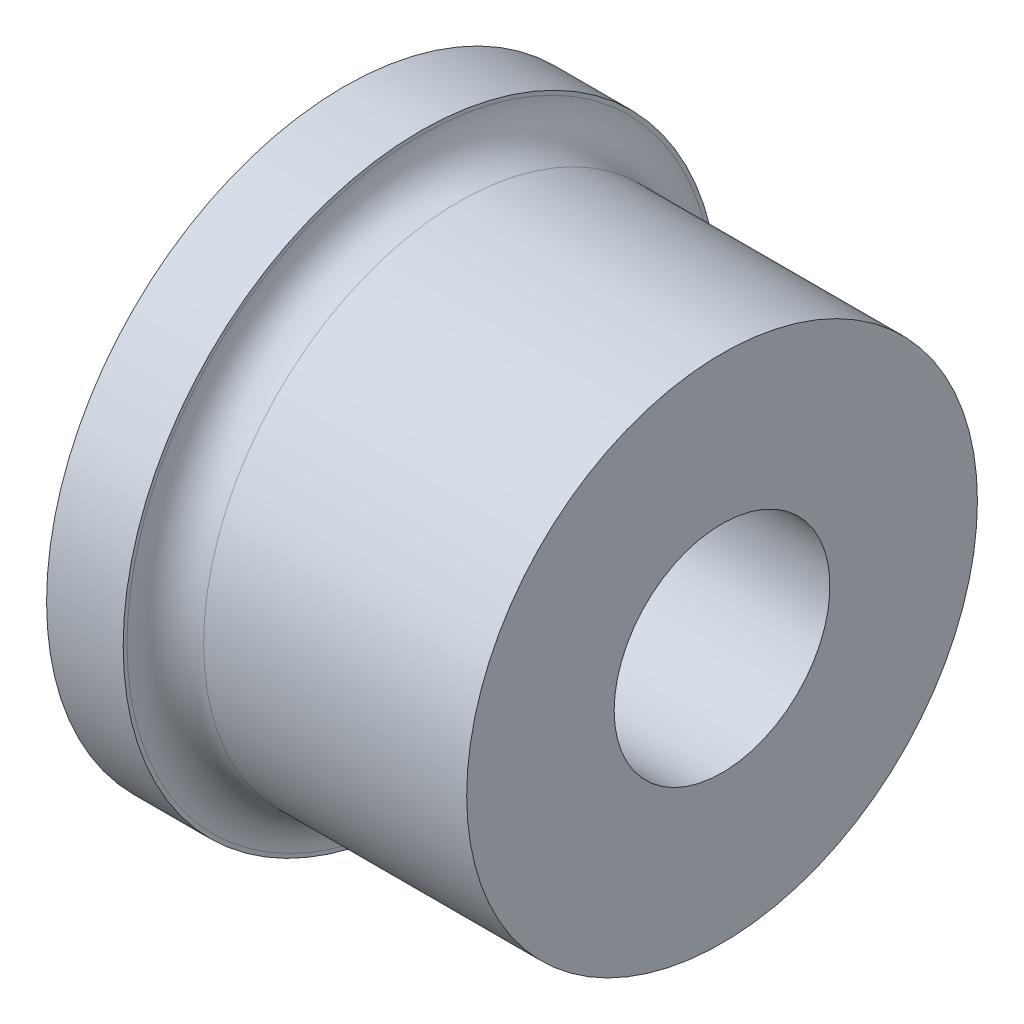
ISO-10303-21;
HEADER;
FILE_DESCRIPTION(('STEP AP214'),'2;1');
FILE_NAME('part.step','',(''),(''),'','','');
FILE_SCHEMA(('AUTOMOTIVE_DESIGN { 1 0 10303 214 1 1 1 1 }'));
ENDSEC;
DATA;
#1=APPLICATION_CONTEXT('core data for automotive mechanical design processes');
#2=APPLICATION_PROTOCOL_DEFINITION('international standard','automotive_design',2000,#1);
#3=PRODUCT_CONTEXT('',#1,'mechanical');
#4=PRODUCT('Part','Part','',(#3));
#5=PRODUCT_RELATED_PRODUCT_CATEGORY('part','',(#4));
#6=PRODUCT_DEFINITION_FORMATION('','',#4);
#7=PRODUCT_DEFINITION_CONTEXT('part definition',#1,'design');
#8=PRODUCT_DEFINITION('design','',#6,#7);
#9=PRODUCT_DEFINITION_SHAPE('','',#8);
#10=(LENGTH_UNIT() NAMED_UNIT(*) SI_UNIT(.MILLI.,.METRE.));
#11=(NAMED_UNIT(*) PLANE_ANGLE_UNIT() SI_UNIT($,.RADIAN.));
#12=(NAMED_UNIT(*) SI_UNIT($,.STERADIAN.) SOLID_ANGLE_UNIT());
#13=UNCERTAINTY_MEASURE_WITH_UNIT(LENGTH_MEASURE(1.E-05),#10,'distance_accuracy_value','');
#14=(GEOMETRIC_REPRESENTATION_CONTEXT(3) GLOBAL_UNCERTAINTY_ASSIGNED_CONTEXT((#13)) GLOBAL_UNIT_ASSIGNED_CONTEXT((#10,
#11,#12)) REPRESENTATION_CONTEXT('',''));
#15=CARTESIAN_POINT('',(0.,0.,0.));
#16=DIRECTION('',(0.,0.,1.));
#17=DIRECTION('',(1.,0.,0.));
#18=AXIS2_PLACEMENT_3D('',#15,#16,#17);
#19=CARTESIAN_POINT('',(-20.8,0.,0.));
#20=DIRECTION('',(1.,0.,0.));
#21=DIRECTION('',(0.,0.,-1.));
#22=AXIS2_PLACEMENT_3D('',#19,#20,#21);
#23=CONICAL_SURFACE('',#22,1.65,0.507629008321349);
#24=CARTESIAN_POINT('',(-21.8,0.,0.));
#25=DIRECTION('',(-1.,0.,0.));
#26=DIRECTION('',(0.,0.,1.));
#27=AXIS2_PLACEMENT_3D('',#24,#25,#26);
#28=CIRCLE('',#27,1.09375);
#29=CARTESIAN_POINT('',(-21.8,0.,1.09375));
#30=VERTEX_POINT('',#29);
#31=EDGE_CURVE('E80',#30,#30,#28,.T.);
#32=ORIENTED_EDGE('',*,*,#31,.F.);
#33=EDGE_LOOP('',(#32));
#34=FACE_BOUND('',#33,.T.);
#35=CARTESIAN_POINT('',(-20.8,0.,0.));
#36=DIRECTION('',(-1.,0.,0.));
#37=DIRECTION('',(0.,0.,1.));
#38=AXIS2_PLACEMENT_3D('',#35,#36,#37);
#39=CIRCLE('',#38,1.65);
#40=CARTESIAN_POINT('',(-20.8,0.,1.65));
#41=VERTEX_POINT('',#40);
#42=EDGE_CURVE('E10',#41,#41,#39,.T.);
#43=ORIENTED_EDGE('',*,*,#42,.T.);
#44=EDGE_LOOP('',(#43));
#45=FACE_BOUND('',#44,.T.);
#46=ADVANCED_FACE('F37',(#34,#45),#23,.T.);
#47=CARTESIAN_POINT('',(-74.8675716184252,0.,0.));
#48=DIRECTION('',(-1.,0.,0.));
#49=DIRECTION('',(0.,0.,1.));
#50=AXIS2_PLACEMENT_3D('',#47,#48,#49);
#51=CYLINDRICAL_SURFACE('',#50,1.65);
#52=ORIENTED_EDGE('',*,*,#42,.F.);
#53=EDGE_LOOP('',(#52));
#54=FACE_BOUND('',#53,.T.);
#55=CARTESIAN_POINT('',(-16.3,0.,0.));
#56=DIRECTION('',(-1.,0.,0.));
#57=DIRECTION('',(0.,0.,1.));
#58=AXIS2_PLACEMENT_3D('',#55,#56,#57);
#59=CIRCLE('',#58,1.65);
#60=CARTESIAN_POINT('',(-16.3,0.,1.65));
#61=VERTEX_POINT('',#60);
#62=EDGE_CURVE('E43',#61,#61,#59,.T.);
#63=ORIENTED_EDGE('',*,*,#62,.T.);
#64=EDGE_LOOP('',(#63));
#65=FACE_BOUND('',#64,.T.);
#66=ADVANCED_FACE('F87',(#54,#65),#51,.T.);
#67=CARTESIAN_POINT('',(-16.3,0.,0.));
#68=DIRECTION('',(-1.,0.,0.));
#69=DIRECTION('',(0.,0.,1.));
#70=AXIS2_PLACEMENT_3D('',#67,#68,#69);
#71=TOROIDAL_SURFACE('',#70,3.15,1.5);
#72=ORIENTED_EDGE('',*,*,#62,.F.);
#73=EDGE_LOOP('',(#72));
#74=FACE_BOUND('',#73,.T.);
#75=CARTESIAN_POINT('',(-14.8,0.,0.));
#76=DIRECTION('',(-1.,0.,0.));
#77=DIRECTION('',(0.,0.,1.));
#78=AXIS2_PLACEMENT_3D('',#75,#76,#77);
#79=CIRCLE('',#78,3.15);
#80=CARTESIAN_POINT('',(-14.8,0.,3.15));
#81=VERTEX_POINT('',#80);
#82=EDGE_CURVE('E47',#81,#81,#79,.T.);
#83=ORIENTED_EDGE('',*,*,#82,.T.);
#84=EDGE_LOOP('',(#83));
#85=FACE_BOUND('',#84,.T.);
#86=ADVANCED_FACE('F91',(#74,#85),#71,.F.);
#87=CARTESIAN_POINT('',(-14.8,0.,-11.65));
#88=DIRECTION('',(1.,0.,0.));
#89=DIRECTION('',(0.,0.,-1.));
#90=AXIS2_PLACEMENT_3D('',#87,#88,#89);
#91=PLANE('',#90);
#92=ORIENTED_EDGE('',*,*,#82,.F.);
#93=EDGE_LOOP('',(#92));
#94=FACE_BOUND('',#93,.T.);
#95=CARTESIAN_POINT('',(-14.8,0.,0.));
#96=DIRECTION('',(-1.,0.,0.));
#97=DIRECTION('',(0.,0.,1.));
#98=AXIS2_PLACEMENT_3D('',#95,#96,#97);
#99=CIRCLE('',#98,11.65);
#100=CARTESIAN_POINT('',(-14.8,0.,11.65));
#101=VERTEX_POINT('',#100);
#102=EDGE_CURVE('E51',#101,#101,#99,.T.);
#103=ORIENTED_EDGE('',*,*,#102,.T.);
#104=EDGE_LOOP('',(#103));
#105=FACE_BOUND('',#104,.T.);
#106=ADVANCED_FACE('F96',(#94,#105),#91,.F.);
#107=CARTESIAN_POINT('',(-74.8675716184252,0.,0.));
#108=DIRECTION('',(-1.,0.,0.));
#109=DIRECTION('',(0.,0.,1.));
#110=AXIS2_PLACEMENT_3D('',#107,#108,#109);
#111=CYLINDRICAL_SURFACE('',#110,11.65);
#112=ORIENTED_EDGE('',*,*,#102,.F.);
#113=EDGE_LOOP('',(#112));
#114=FACE_BOUND('',#113,.T.);
#115=CARTESIAN_POINT('',(-11.8,0.,0.));
#116=DIRECTION('',(-1.,0.,0.));
#117=DIRECTION('',(0.,0.,1.));
#118=AXIS2_PLACEMENT_3D('',#115,#116,#117);
#119=CIRCLE('',#118,11.65);
#120=CARTESIAN_POINT('',(-11.8,0.,11.65));
#121=VERTEX_POINT('',#120);
#122=EDGE_CURVE('E56',#121,#121,#119,.T.);
#123=ORIENTED_EDGE('',*,*,#122,.T.);
#124=EDGE_LOOP('',(#123));
#125=FACE_BOUND('',#124,.T.);
#126=ADVANCED_FACE('F102',(#114,#125),#111,.T.);
#127=CARTESIAN_POINT('',(-11.8,0.,-11.5));
#128=DIRECTION('',(-1.,0.,0.));
#129=DIRECTION('',(0.,0.,1.));
#130=AXIS2_PLACEMENT_3D('',#127,#128,#129);
#131=PLANE('',#130);
#132=ORIENTED_EDGE('',*,*,#122,.F.);
#133=EDGE_LOOP('',(#132));
#134=FACE_BOUND('',#133,.T.);
#135=CARTESIAN_POINT('',(-11.8,0.,0.));
#136=DIRECTION('',(-1.,0.,0.));
#137=DIRECTION('',(0.,0.,1.));
#138=AXIS2_PLACEMENT_3D('',#135,#136,#137);
#139=CIRCLE('',#138,11.5);
#140=CARTESIAN_POINT('',(-11.8,0.,11.5));
#141=VERTEX_POINT('',#140);
#142=EDGE_CURVE('E59',#141,#141,#139,.T.);
#143=ORIENTED_EDGE('',*,*,#142,.T.);
#144=EDGE_LOOP('',(#143));
#145=FACE_BOUND('',#144,.T.);
#146=ADVANCED_FACE('F106',(#134,#145),#131,.F.);
#147=CARTESIAN_POINT('',(-10.3,0.,0.));
#148=DIRECTION('',(-1.,0.,0.));
#149=DIRECTION('',(0.,0.,1.));
#150=AXIS2_PLACEMENT_3D('',#147,#148,#149);
#151=TOROIDAL_SURFACE('',#150,11.5,1.5);
#152=ORIENTED_EDGE('',*,*,#142,.F.);
#153=EDGE_LOOP('',(#152));
#154=FACE_BOUND('',#153,.T.);
#155=CARTESIAN_POINT('',(-10.3,0.,0.));
#156=DIRECTION('',(-1.,0.,0.));
#157=DIRECTION('',(0.,0.,1.));
#158=AXIS2_PLACEMENT_3D('',#155,#156,#157);
#159=CIRCLE('',#158,10.);
#160=CARTESIAN_POINT('',(-10.3,0.,10.));
#161=VERTEX_POINT('',#160);
#162=EDGE_CURVE('E62',#161,#161,#159,.T.);
#163=ORIENTED_EDGE('',*,*,#162,.T.);
#164=EDGE_LOOP('',(#163));
#165=FACE_BOUND('',#164,.T.);
#166=ADVANCED_FACE('F110',(#154,#165),#151,.F.);
#167=CARTESIAN_POINT('',(-74.8675716184252,0.,0.));
#168=DIRECTION('',(-1.,0.,0.));
#169=DIRECTION('',(0.,0.,1.));
#170=AXIS2_PLACEMENT_3D('',#167,#168,#169);
#171=CYLINDRICAL_SURFACE('',#170,10.);
#172=ORIENTED_EDGE('',*,*,#162,.F.);
#173=EDGE_LOOP('',(#172));
#174=FACE_BOUND('',#173,.T.);
#175=CARTESIAN_POINT('',(0.,0.,0.));
#176=DIRECTION('',(-1.,0.,0.));
#177=DIRECTION('',(0.,0.,1.));
#178=AXIS2_PLACEMENT_3D('',#175,#176,#177);
#179=CIRCLE('',#178,10.);
#180=CARTESIAN_POINT('',(0.,0.,10.));
#181=VERTEX_POINT('',#180);
#182=EDGE_CURVE('E65',#181,#181,#179,.T.);
#183=ORIENTED_EDGE('',*,*,#182,.T.);
#184=EDGE_LOOP('',(#183));
#185=FACE_BOUND('',#184,.T.);
#186=ADVANCED_FACE('F114',(#174,#185),#171,.T.);
#187=CARTESIAN_POINT('',(0.,0.,-10.));
#188=DIRECTION('',(-1.,0.,0.));
#189=DIRECTION('',(0.,0.,1.));
#190=AXIS2_PLACEMENT_3D('',#187,#188,#189);
#191=PLANE('',#190);
#192=ORIENTED_EDGE('',*,*,#182,.F.);
#193=EDGE_LOOP('',(#192));
#194=FACE_BOUND('',#193,.T.);
#195=CARTESIAN_POINT('',(0.,0.,0.));
#196=DIRECTION('',(-1.,0.,0.));
#197=DIRECTION('',(0.,0.,1.));
#198=AXIS2_PLACEMENT_3D('',#195,#196,#197);
#199=CIRCLE('',#198,4.225);
#200=CARTESIAN_POINT('',(0.,0.,4.225));
#201=VERTEX_POINT('',#200);
#202=EDGE_CURVE('E68',#201,#201,#199,.T.);
#203=ORIENTED_EDGE('',*,*,#202,.T.);
#204=EDGE_LOOP('',(#203));
#205=FACE_BOUND('',#204,.T.);
#206=ADVANCED_FACE('F118',(#194,#205),#191,.F.);
#207=CARTESIAN_POINT('',(-74.8675716184252,0.,0.));
#208=DIRECTION('',(-1.,0.,0.));
#209=DIRECTION('',(0.,0.,1.));
#210=AXIS2_PLACEMENT_3D('',#207,#208,#209);
#211=CYLINDRICAL_SURFACE('',#210,4.225);
#212=ORIENTED_EDGE('',*,*,#202,.F.);
#213=EDGE_LOOP('',(#212));
#214=FACE_BOUND('',#213,.T.);
#215=CARTESIAN_POINT('',(-9.8,0.,0.));
#216=DIRECTION('',(-1.,0.,0.));
#217=DIRECTION('',(0.,0.,1.));
#218=AXIS2_PLACEMENT_3D('',#215,#216,#217);
#219=CIRCLE('',#218,4.225);
#220=CARTESIAN_POINT('',(-9.8,0.,4.225));
#221=VERTEX_POINT('',#220);
#222=EDGE_CURVE('E71',#221,#221,#219,.T.);
#223=ORIENTED_EDGE('',*,*,#222,.T.);
#224=EDGE_LOOP('',(#223));
#225=FACE_BOUND('',#224,.T.);
#226=ADVANCED_FACE('F122',(#214,#225),#211,.F.);
#227=CARTESIAN_POINT('',(-9.8,0.,-0.79375));
#228=DIRECTION('',(-1.,0.,0.));
#229=DIRECTION('',(0.,0.,1.));
#230=AXIS2_PLACEMENT_3D('',#227,#228,#229);
#231=PLANE('',#230);
#232=ORIENTED_EDGE('',*,*,#222,.F.);
#233=EDGE_LOOP('',(#232));
#234=FACE_BOUND('',#233,.T.);
#235=CARTESIAN_POINT('',(-9.8,0.,0.));
#236=DIRECTION('',(-1.,0.,0.));
#237=DIRECTION('',(0.,0.,1.));
#238=AXIS2_PLACEMENT_3D('',#235,#236,#237);
#239=CIRCLE('',#238,0.79375);
#240=CARTESIAN_POINT('',(-9.8,0.,0.79375));
#241=VERTEX_POINT('',#240);
#242=EDGE_CURVE('E74',#241,#241,#239,.T.);
#243=ORIENTED_EDGE('',*,*,#242,.T.);
#244=EDGE_LOOP('',(#243));
#245=FACE_BOUND('',#244,.T.);
#246=ADVANCED_FACE('F126',(#234,#245),#231,.F.);
#247=CARTESIAN_POINT('',(-74.8675716184252,0.,0.));
#248=DIRECTION('',(-1.,0.,0.));
#249=DIRECTION('',(0.,0.,1.));
#250=AXIS2_PLACEMENT_3D('',#247,#248,#249);
#251=CYLINDRICAL_SURFACE('',#250,0.79375);
#252=ORIENTED_EDGE('',*,*,#242,.F.);
#253=EDGE_LOOP('',(#252));
#254=FACE_BOUND('',#253,.T.);
#255=CARTESIAN_POINT('',(-21.8,0.,0.));
#256=DIRECTION('',(-1.,0.,0.));
#257=DIRECTION('',(0.,0.,1.));
#258=AXIS2_PLACEMENT_3D('',#255,#256,#257);
#259=CIRCLE('',#258,0.79375);
#260=CARTESIAN_POINT('',(-21.8,0.,0.79375));
#261=VERTEX_POINT('',#260);
#262=EDGE_CURVE('E77',#261,#261,#259,.T.);
#263=ORIENTED_EDGE('',*,*,#262,.T.);
#264=EDGE_LOOP('',(#263));
#265=FACE_BOUND('',#264,.T.);
#266=ADVANCED_FACE('F130',(#254,#265),#251,.F.);
#267=CARTESIAN_POINT('',(-21.8,0.,-1.09375));
#268=DIRECTION('',(1.,0.,0.));
#269=DIRECTION('',(0.,0.,-1.));
#270=AXIS2_PLACEMENT_3D('',#267,#268,#269);
#271=PLANE('',#270);
#272=ORIENTED_EDGE('',*,*,#262,.F.);
#273=EDGE_LOOP('',(#272));
#274=FACE_BOUND('',#273,.T.);
#275=ORIENTED_EDGE('',*,*,#31,.T.);
#276=EDGE_LOOP('',(#275));
#277=FACE_BOUND('',#276,.T.);
#278=ADVANCED_FACE('F84',(#274,#277),#271,.F.);
#279=CLOSED_SHELL('',(#46,#66,#86,#106,#126,#146,#166,#186,#206,#226,#246,#266,#278));
#280=MANIFOLD_SOLID_BREP('B2',#279);
#281=ADVANCED_BREP_SHAPE_REPRESENTATION('',(#18,#280),#14);
#282=SHAPE_DEFINITION_REPRESENTATION(#9,#281);
ENDSEC;
END-ISO-10303-21;
